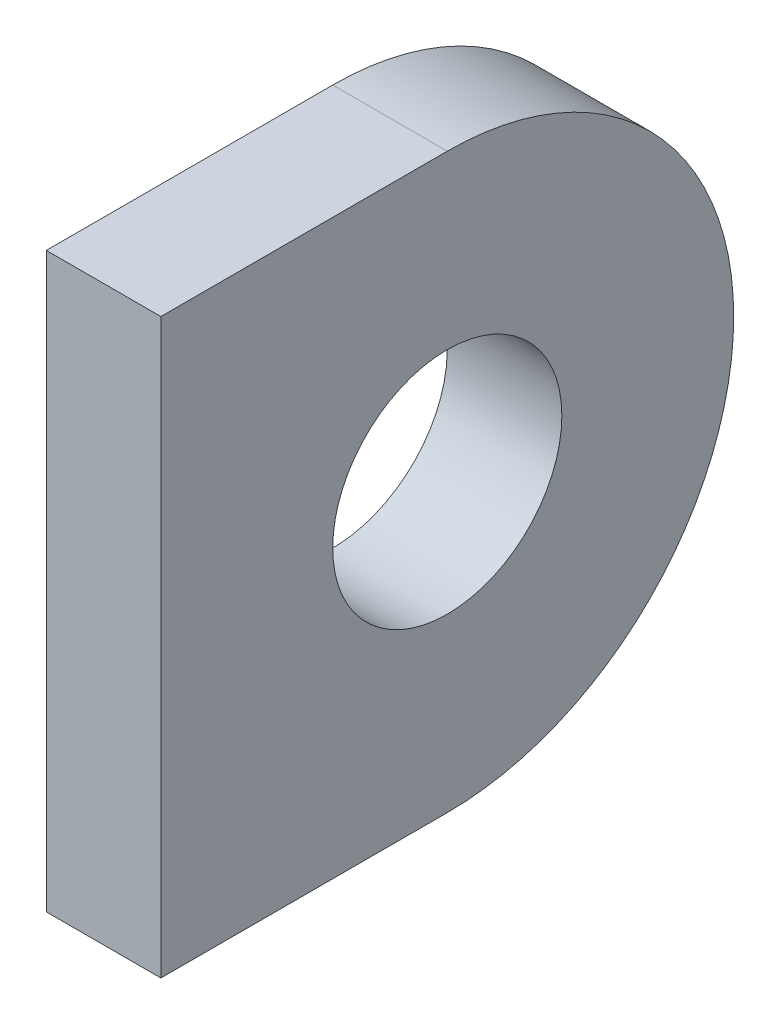
ISO-10303-21;
HEADER;
FILE_DESCRIPTION(('STEP AP214'),'2;1');
FILE_NAME('part.step','',(''),(''),'','','');
FILE_SCHEMA(('AUTOMOTIVE_DESIGN { 1 0 10303 214 1 1 1 1 }'));
ENDSEC;
DATA;
#1=APPLICATION_CONTEXT('core data for automotive mechanical design processes');
#2=APPLICATION_PROTOCOL_DEFINITION('international standard','automotive_design',2000,#1);
#3=PRODUCT_CONTEXT('',#1,'mechanical');
#4=PRODUCT('Part','Part','',(#3));
#5=PRODUCT_RELATED_PRODUCT_CATEGORY('part','',(#4));
#6=PRODUCT_DEFINITION_FORMATION('','',#4);
#7=PRODUCT_DEFINITION_CONTEXT('part definition',#1,'design');
#8=PRODUCT_DEFINITION('design','',#6,#7);
#9=PRODUCT_DEFINITION_SHAPE('','',#8);
#10=(LENGTH_UNIT() NAMED_UNIT(*) SI_UNIT(.MILLI.,.METRE.));
#11=(NAMED_UNIT(*) PLANE_ANGLE_UNIT() SI_UNIT($,.RADIAN.));
#12=(NAMED_UNIT(*) SI_UNIT($,.STERADIAN.) SOLID_ANGLE_UNIT());
#13=UNCERTAINTY_MEASURE_WITH_UNIT(LENGTH_MEASURE(1.E-05),#10,'distance_accuracy_value','');
#14=(GEOMETRIC_REPRESENTATION_CONTEXT(3) GLOBAL_UNCERTAINTY_ASSIGNED_CONTEXT((#13)) GLOBAL_UNIT_ASSIGNED_CONTEXT((#10,
#11,#12)) REPRESENTATION_CONTEXT('',''));
#15=CARTESIAN_POINT('',(0.,0.,0.));
#16=DIRECTION('',(0.,0.,1.));
#17=DIRECTION('',(1.,0.,0.));
#18=AXIS2_PLACEMENT_3D('',#15,#16,#17);
#19=CARTESIAN_POINT('',(165.,0.,-14.));
#20=DIRECTION('',(1.,0.,0.));
#21=DIRECTION('',(0.,1.,0.));
#22=AXIS2_PLACEMENT_3D('',#19,#20,#21);
#23=CYLINDRICAL_SURFACE('',#22,10.);
#24=DIRECTION('',(1.,0.,0.));
#25=VECTOR('',#24,1.);
#26=CARTESIAN_POINT('',(165.000000000001,0.,-23.9999999999999));
#27=LINE('',#26,#25);
#28=CARTESIAN_POINT('',(161.,0.,-24.));
#29=VERTEX_POINT('',#28);
#30=CARTESIAN_POINT('',(165.000000000001,0.,-23.9999999999999));
#31=VERTEX_POINT('',#30);
#32=EDGE_CURVE('E11',#29,#31,#27,.T.);
#33=ORIENTED_EDGE('',*,*,#32,.F.);
#34=CARTESIAN_POINT('',(161.,0.,-14.));
#35=DIRECTION('',(1.,0.,0.));
#36=DIRECTION('',(0.,1.,0.));
#37=AXIS2_PLACEMENT_3D('',#34,#35,#36);
#38=CIRCLE('',#37,10.);
#39=CARTESIAN_POINT('',(161.000000000001,9.99999999999925,-13.9999999999991));
#40=VERTEX_POINT('',#39);
#41=EDGE_CURVE('E101',#29,#40,#38,.T.);
#42=ORIENTED_EDGE('',*,*,#41,.T.);
#43=DIRECTION('',(1.,0.,0.));
#44=VECTOR('',#43,1.);
#45=CARTESIAN_POINT('',(165.,9.9999999999999,-14.));
#46=LINE('',#45,#44);
#47=CARTESIAN_POINT('',(165.,9.9999999999999,-14.));
#48=VERTEX_POINT('',#47);
#49=EDGE_CURVE('E53',#40,#48,#46,.T.);
#50=ORIENTED_EDGE('',*,*,#49,.T.);
#51=CARTESIAN_POINT('',(165.,0.,-14.));
#52=DIRECTION('',(1.,0.,0.));
#53=DIRECTION('',(0.,0.,-0.999999999999968));
#54=AXIS2_PLACEMENT_3D('',#51,#52,#53);
#55=CIRCLE('',#54,10.);
#56=EDGE_CURVE('E130',#31,#48,#55,.T.);
#57=ORIENTED_EDGE('',*,*,#56,.F.);
#58=EDGE_LOOP('',(#33,#42,#50,#57));
#59=FACE_BOUND('',#58,.T.);
#60=ADVANCED_FACE('F43',(#59),#23,.T.);
#61=CARTESIAN_POINT('',(165.,9.99999999999995,-4.));
#62=DIRECTION('',(0.,1.,0.));
#63=DIRECTION('',(0.,0.,0.999999999999968));
#64=AXIS2_PLACEMENT_3D('',#61,#62,#63);
#65=PLANE('',#64);
#66=ORIENTED_EDGE('',*,*,#49,.F.);
#67=DIRECTION('',(0.,0.,-0.999999999999968));
#68=VECTOR('',#67,1.);
#69=CARTESIAN_POINT('',(161.000000000001,9.99999999999925,0.));
#70=LINE('',#69,#68);
#71=CARTESIAN_POINT('',(161.000000000001,9.9999999999993,-3.99999999999975));
#72=VERTEX_POINT('',#71);
#73=EDGE_CURVE('E118',#40,#72,#70,.F.);
#74=ORIENTED_EDGE('',*,*,#73,.T.);
#75=DIRECTION('',(1.,0.,0.));
#76=VECTOR('',#75,1.);
#77=CARTESIAN_POINT('',(165.,9.99999999999995,-4.));
#78=LINE('',#77,#76);
#79=CARTESIAN_POINT('',(165.,9.99999999999995,-4.));
#80=VERTEX_POINT('',#79);
#81=EDGE_CURVE('E125',#72,#80,#78,.T.);
#82=ORIENTED_EDGE('',*,*,#81,.T.);
#83=DIRECTION('',(0.,0.,0.999999999999968));
#84=VECTOR('',#83,1.);
#85=CARTESIAN_POINT('',(165.,9.99999999999995,-4.));
#86=LINE('',#85,#84);
#87=EDGE_CURVE('E137',#48,#80,#86,.T.);
#88=ORIENTED_EDGE('',*,*,#87,.F.);
#89=EDGE_LOOP('',(#66,#74,#82,#88));
#90=FACE_BOUND('',#89,.T.);
#91=ADVANCED_FACE('F140',(#90),#65,.T.);
#92=CARTESIAN_POINT('',(165.,9.99999999999995,-4.));
#93=DIRECTION('',(0.,0.,1.));
#94=DIRECTION('',(0.,-1.,0.));
#95=AXIS2_PLACEMENT_3D('',#92,#93,#94);
#96=PLANE('',#95);
#97=ORIENTED_EDGE('',*,*,#81,.F.);
#98=DIRECTION('',(0.,0.999999999999967,0.));
#99=VECTOR('',#98,1.);
#100=CARTESIAN_POINT('',(161.000000000001,0.,-3.99999999999975));
#101=LINE('',#100,#99);
#102=CARTESIAN_POINT('',(161.000000000001,-9.99999999999941,-3.99999999999975));
#103=VERTEX_POINT('',#102);
#104=EDGE_CURVE('E114',#72,#103,#101,.F.);
#105=ORIENTED_EDGE('',*,*,#104,.T.);
#106=DIRECTION('',(1.,0.,0.));
#107=VECTOR('',#106,1.);
#108=CARTESIAN_POINT('',(165.,-10.0000000000001,-4.));
#109=LINE('',#108,#107);
#110=CARTESIAN_POINT('',(165.,-10.0000000000001,-4.));
#111=VERTEX_POINT('',#110);
#112=EDGE_CURVE('E61',#103,#111,#109,.T.);
#113=ORIENTED_EDGE('',*,*,#112,.T.);
#114=DIRECTION('',(0.,-1.,0.));
#115=VECTOR('',#114,1.);
#116=CARTESIAN_POINT('',(165.,9.99999999999995,-4.));
#117=LINE('',#116,#115);
#118=EDGE_CURVE('E94',#80,#111,#117,.T.);
#119=ORIENTED_EDGE('',*,*,#118,.F.);
#120=EDGE_LOOP('',(#97,#105,#113,#119));
#121=FACE_BOUND('',#120,.T.);
#122=ADVANCED_FACE('F175',(#121),#96,.T.);
#123=CARTESIAN_POINT('',(165.,-10.0000000000001,-4.));
#124=DIRECTION('',(0.,-1.,0.));
#125=DIRECTION('',(0.,0.,-0.999999999999968));
#126=AXIS2_PLACEMENT_3D('',#123,#124,#125);
#127=PLANE('',#126);
#128=ORIENTED_EDGE('',*,*,#112,.F.);
#129=DIRECTION('',(0.,0.,-0.999999999999968));
#130=VECTOR('',#129,1.);
#131=CARTESIAN_POINT('',(161.000000000001,-9.99999999999941,0.));
#132=LINE('',#131,#130);
#133=CARTESIAN_POINT('',(161.000000000001,-9.99999999999941,-13.9999999999991));
#134=VERTEX_POINT('',#133);
#135=EDGE_CURVE('E99',#103,#134,#132,.T.);
#136=ORIENTED_EDGE('',*,*,#135,.T.);
#137=DIRECTION('',(1.,0.,0.));
#138=VECTOR('',#137,1.);
#139=CARTESIAN_POINT('',(165.,-10.0000000000001,-14.));
#140=LINE('',#139,#138);
#141=CARTESIAN_POINT('',(165.,-10.0000000000001,-14.));
#142=VERTEX_POINT('',#141);
#143=EDGE_CURVE('E47',#134,#142,#140,.T.);
#144=ORIENTED_EDGE('',*,*,#143,.T.);
#145=DIRECTION('',(0.,0.,-0.999999999999968));
#146=VECTOR('',#145,1.);
#147=CARTESIAN_POINT('',(165.,-10.0000000000001,-4.));
#148=LINE('',#147,#146);
#149=EDGE_CURVE('E148',#111,#142,#148,.T.);
#150=ORIENTED_EDGE('',*,*,#149,.F.);
#151=EDGE_LOOP('',(#128,#136,#144,#150));
#152=FACE_BOUND('',#151,.T.);
#153=ADVANCED_FACE('F104',(#152),#127,.T.);
#154=CARTESIAN_POINT('',(165.,0.,-14.));
#155=DIRECTION('',(1.,0.,0.));
#156=DIRECTION('',(0.,1.,0.));
#157=AXIS2_PLACEMENT_3D('',#154,#155,#156);
#158=CYLINDRICAL_SURFACE('',#157,4.);
#159=CARTESIAN_POINT('',(165.,0.,-14.));
#160=DIRECTION('',(1.,0.,0.));
#161=DIRECTION('',(0.,0.,-0.999999999999968));
#162=AXIS2_PLACEMENT_3D('',#159,#160,#161);
#163=CIRCLE('',#162,4.);
#164=CARTESIAN_POINT('',(165.,0.,-17.9999999999999));
#165=VERTEX_POINT('',#164);
#166=EDGE_CURVE('E117',#165,#165,#163,.T.);
#167=ORIENTED_EDGE('',*,*,#166,.T.);
#168=EDGE_LOOP('',(#167));
#169=FACE_BOUND('',#168,.T.);
#170=CARTESIAN_POINT('',(161.,0.,-14.));
#171=DIRECTION('',(1.,0.,0.));
#172=DIRECTION('',(0.,1.,0.));
#173=AXIS2_PLACEMENT_3D('',#170,#171,#172);
#174=CIRCLE('',#173,4.);
#175=CARTESIAN_POINT('',(161.,3.99999999999995,-14.));
#176=VERTEX_POINT('',#175);
#177=EDGE_CURVE('E106',#176,#176,#174,.T.);
#178=ORIENTED_EDGE('',*,*,#177,.F.);
#179=EDGE_LOOP('',(#178));
#180=FACE_BOUND('',#179,.T.);
#181=ADVANCED_FACE('F156',(#169,#180),#158,.F.);
#182=CARTESIAN_POINT('',(165.,0.,-14.));
#183=DIRECTION('',(1.,0.,0.));
#184=DIRECTION('',(0.,1.,0.));
#185=AXIS2_PLACEMENT_3D('',#182,#183,#184);
#186=CYLINDRICAL_SURFACE('',#185,10.);
#187=CARTESIAN_POINT('',(161.,0.,-14.));
#188=DIRECTION('',(1.,0.,0.));
#189=DIRECTION('',(0.,1.,0.));
#190=AXIS2_PLACEMENT_3D('',#187,#188,#189);
#191=CIRCLE('',#190,10.);
#192=EDGE_CURVE('E88',#134,#29,#191,.T.);
#193=ORIENTED_EDGE('',*,*,#192,.T.);
#194=ORIENTED_EDGE('',*,*,#32,.T.);
#195=CARTESIAN_POINT('',(165.,0.,-14.));
#196=DIRECTION('',(1.,0.,0.));
#197=DIRECTION('',(0.,0.,-0.999999999999968));
#198=AXIS2_PLACEMENT_3D('',#195,#196,#197);
#199=CIRCLE('',#198,10.);
#200=EDGE_CURVE('E90',#142,#31,#199,.T.);
#201=ORIENTED_EDGE('',*,*,#200,.F.);
#202=ORIENTED_EDGE('',*,*,#143,.F.);
#203=EDGE_LOOP('',(#193,#194,#201,#202));
#204=FACE_BOUND('',#203,.T.);
#205=ADVANCED_FACE('F45',(#204),#186,.T.);
#206=CARTESIAN_POINT('',(165.000000000001,0.,0.));
#207=DIRECTION('',(1.,0.,0.));
#208=DIRECTION('',(0.,0.,-0.999999999999968));
#209=AXIS2_PLACEMENT_3D('',#206,#207,#208);
#210=PLANE('',#209);
#211=ORIENTED_EDGE('',*,*,#166,.F.);
#212=EDGE_LOOP('',(#211));
#213=FACE_BOUND('',#212,.T.);
#214=ORIENTED_EDGE('',*,*,#149,.T.);
#215=ORIENTED_EDGE('',*,*,#200,.T.);
#216=ORIENTED_EDGE('',*,*,#56,.T.);
#217=ORIENTED_EDGE('',*,*,#87,.T.);
#218=ORIENTED_EDGE('',*,*,#118,.T.);
#219=EDGE_LOOP('',(#214,#215,#216,#217,#218));
#220=FACE_BOUND('',#219,.T.);
#221=ADVANCED_FACE('F135',(#213,#220),#210,.T.);
#222=CARTESIAN_POINT('',(161.000000000001,0.,0.));
#223=DIRECTION('',(1.,0.,0.));
#224=DIRECTION('',(0.,0.,-0.999999999999968));
#225=AXIS2_PLACEMENT_3D('',#222,#223,#224);
#226=PLANE('',#225);
#227=ORIENTED_EDGE('',*,*,#177,.T.);
#228=EDGE_LOOP('',(#227));
#229=FACE_BOUND('',#228,.T.);
#230=ORIENTED_EDGE('',*,*,#135,.F.);
#231=ORIENTED_EDGE('',*,*,#104,.F.);
#232=ORIENTED_EDGE('',*,*,#73,.F.);
#233=ORIENTED_EDGE('',*,*,#41,.F.);
#234=ORIENTED_EDGE('',*,*,#192,.F.);
#235=EDGE_LOOP('',(#230,#231,#232,#233,#234));
#236=FACE_BOUND('',#235,.T.);
#237=ADVANCED_FACE('F97',(#229,#236),#226,.F.);
#238=CLOSED_SHELL('',(#60,#91,#122,#153,#181,#205,#221,#237));
#239=MANIFOLD_SOLID_BREP('B2',#238);
#240=ADVANCED_BREP_SHAPE_REPRESENTATION('',(#18,#239),#14);
#241=SHAPE_DEFINITION_REPRESENTATION(#9,#240);
ENDSEC;
END-ISO-10303-21;
